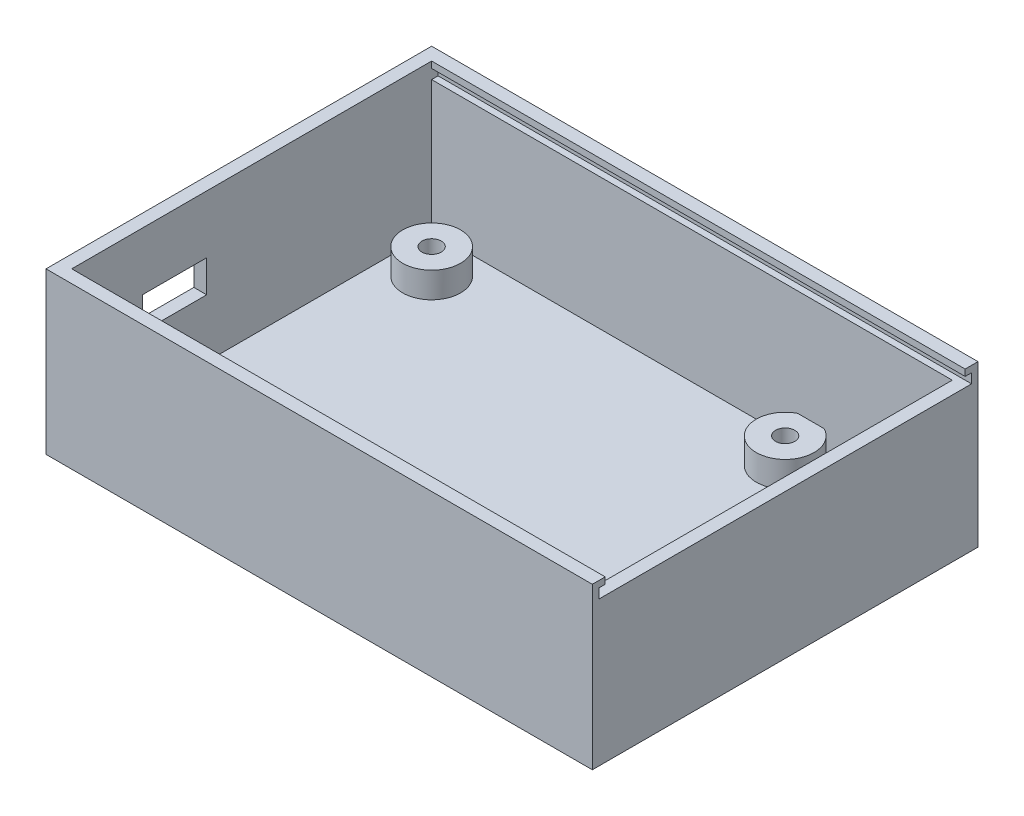
ISO-10303-21;
HEADER;
FILE_DESCRIPTION(('STEP AP214'),'2;1');
FILE_NAME('part.step','',(''),(''),'','','');
FILE_SCHEMA(('AUTOMOTIVE_DESIGN { 1 0 10303 214 1 1 1 1 }'));
ENDSEC;
DATA;
#1=APPLICATION_CONTEXT('core data for automotive mechanical design processes');
#2=APPLICATION_PROTOCOL_DEFINITION('international standard','automotive_design',2000,#1);
#3=PRODUCT_CONTEXT('',#1,'mechanical');
#4=PRODUCT('Part','Part','',(#3));
#5=PRODUCT_RELATED_PRODUCT_CATEGORY('part','',(#4));
#6=PRODUCT_DEFINITION_FORMATION('','',#4);
#7=PRODUCT_DEFINITION_CONTEXT('part definition',#1,'design');
#8=PRODUCT_DEFINITION('design','',#6,#7);
#9=PRODUCT_DEFINITION_SHAPE('','',#8);
#10=(LENGTH_UNIT() NAMED_UNIT(*) SI_UNIT(.MILLI.,.METRE.));
#11=(NAMED_UNIT(*) PLANE_ANGLE_UNIT() SI_UNIT($,.RADIAN.));
#12=(NAMED_UNIT(*) SI_UNIT($,.STERADIAN.) SOLID_ANGLE_UNIT());
#13=UNCERTAINTY_MEASURE_WITH_UNIT(LENGTH_MEASURE(1.E-05),#10,'distance_accuracy_value','');
#14=(GEOMETRIC_REPRESENTATION_CONTEXT(3) GLOBAL_UNCERTAINTY_ASSIGNED_CONTEXT((#13)) GLOBAL_UNIT_ASSIGNED_CONTEXT((#10,
#11,#12)) REPRESENTATION_CONTEXT('',''));
#15=CARTESIAN_POINT('',(0.,0.,0.));
#16=DIRECTION('',(0.,0.,1.));
#17=DIRECTION('',(1.,0.,0.));
#18=AXIS2_PLACEMENT_3D('',#15,#16,#17);
#19=CARTESIAN_POINT('',(0.,25.,-58.));
#20=DIRECTION('',(0.,0.,1.));
#21=DIRECTION('',(1.,0.,0.));
#22=AXIS2_PLACEMENT_3D('',#19,#20,#21);
#23=PLANE('',#22);
#24=DIRECTION('',(0.,-1.,0.));
#25=VECTOR('',#24,1.);
#26=CARTESIAN_POINT('',(2.,25.,-58.));
#27=LINE('',#26,#25);
#28=CARTESIAN_POINT('',(2.,25.,-58.));
#29=VERTEX_POINT('',#28);
#30=CARTESIAN_POINT('',(2.,24.,-58.));
#31=VERTEX_POINT('',#30);
#32=EDGE_CURVE('E304',#29,#31,#27,.T.);
#33=ORIENTED_EDGE('',*,*,#32,.T.);
#34=DIRECTION('',(1.,0.,0.));
#35=VECTOR('',#34,1.);
#36=CARTESIAN_POINT('',(-0.001000000000001,24.,-58.));
#37=LINE('',#36,#35);
#38=CARTESIAN_POINT('',(85.,24.,-58.));
#39=VERTEX_POINT('',#38);
#40=EDGE_CURVE('E232',#31,#39,#37,.T.);
#41=ORIENTED_EDGE('',*,*,#40,.T.);
#42=DIRECTION('',(0.,1.,0.));
#43=VECTOR('',#42,1.);
#44=CARTESIAN_POINT('',(85.,25.,-58.));
#45=LINE('',#44,#43);
#46=CARTESIAN_POINT('',(85.,25.,-58.));
#47=VERTEX_POINT('',#46);
#48=EDGE_CURVE('E228',#39,#47,#45,.T.);
#49=ORIENTED_EDGE('',*,*,#48,.T.);
#50=DIRECTION('',(-1.,0.,0.));
#51=VECTOR('',#50,1.);
#52=CARTESIAN_POINT('',(0.,25.,-58.));
#53=LINE('',#52,#51);
#54=EDGE_CURVE('E325',#47,#29,#53,.T.);
#55=ORIENTED_EDGE('',*,*,#54,.T.);
#56=EDGE_LOOP('',(#33,#41,#49,#55));
#57=FACE_BOUND('',#56,.T.);
#58=ADVANCED_FACE('F34',(#57),#23,.T.);
#59=CARTESIAN_POINT('',(0.,25.,-2.));
#60=DIRECTION('',(0.,0.,-1.));
#61=DIRECTION('',(-1.,0.,0.));
#62=AXIS2_PLACEMENT_3D('',#59,#60,#61);
#63=PLANE('',#62);
#64=DIRECTION('',(1.,0.,0.));
#65=VECTOR('',#64,1.);
#66=CARTESIAN_POINT('',(-0.001000000000001,24.,-2.));
#67=LINE('',#66,#65);
#68=CARTESIAN_POINT('',(2.,24.,-2.));
#69=VERTEX_POINT('',#68);
#70=CARTESIAN_POINT('',(85.,24.,-2.));
#71=VERTEX_POINT('',#70);
#72=EDGE_CURVE('E231',#69,#71,#67,.T.);
#73=ORIENTED_EDGE('',*,*,#72,.F.);
#74=DIRECTION('',(0.,-1.,0.));
#75=VECTOR('',#74,1.);
#76=CARTESIAN_POINT('',(2.,25.,-2.));
#77=LINE('',#76,#75);
#78=CARTESIAN_POINT('',(2.,25.,-2.));
#79=VERTEX_POINT('',#78);
#80=EDGE_CURVE('E299',#79,#69,#77,.T.);
#81=ORIENTED_EDGE('',*,*,#80,.F.);
#82=DIRECTION('',(1.,0.,0.));
#83=VECTOR('',#82,1.);
#84=CARTESIAN_POINT('',(0.,25.,-2.));
#85=LINE('',#84,#83);
#86=CARTESIAN_POINT('',(85.,25.,-2.));
#87=VERTEX_POINT('',#86);
#88=EDGE_CURVE('E323',#79,#87,#85,.T.);
#89=ORIENTED_EDGE('',*,*,#88,.T.);
#90=DIRECTION('',(0.,-1.,0.));
#91=VECTOR('',#90,1.);
#92=CARTESIAN_POINT('',(85.,25.,-2.));
#93=LINE('',#92,#91);
#94=EDGE_CURVE('E225',#87,#71,#93,.T.);
#95=ORIENTED_EDGE('',*,*,#94,.T.);
#96=EDGE_LOOP('',(#73,#81,#89,#95));
#97=FACE_BOUND('',#96,.T.);
#98=ADVANCED_FACE('F376',(#97),#63,.T.);
#99=CARTESIAN_POINT('',(0.,2.,0.));
#100=DIRECTION('',(0.,-1.,0.));
#101=DIRECTION('',(0.,0.,-1.));
#102=AXIS2_PLACEMENT_3D('',#99,#100,#101);
#103=PLANE('',#102);
#104=CARTESIAN_POINT('',(7.99999999999999,2.,-52.));
#105=DIRECTION('',(0.,-1.,0.));
#106=DIRECTION('',(0.,0.,-1.));
#107=AXIS2_PLACEMENT_3D('',#104,#105,#106);
#108=CIRCLE('',#107,4.5);
#109=CARTESIAN_POINT('',(7.99999999999999,2.,-56.5));
#110=VERTEX_POINT('',#109);
#111=EDGE_CURVE('E358',#110,#110,#108,.F.);
#112=ORIENTED_EDGE('',*,*,#111,.F.);
#113=EDGE_LOOP('',(#112));
#114=FACE_BOUND('',#113,.T.);
#115=CARTESIAN_POINT('',(61.,2.,-54.));
#116=DIRECTION('',(0.,1.,0.));
#117=DIRECTION('',(0.,0.,1.));
#118=AXIS2_PLACEMENT_3D('',#115,#116,#117);
#119=CIRCLE('',#118,4.5);
#120=CARTESIAN_POINT('',(58.9384471871912,2.,-58.));
#121=VERTEX_POINT('',#120);
#122=CARTESIAN_POINT('',(63.0615528128088,2.,-58.));
#123=VERTEX_POINT('',#122);
#124=EDGE_CURVE('E279',#121,#123,#119,.T.);
#125=ORIENTED_EDGE('',*,*,#124,.F.);
#126=DIRECTION('',(-1.,0.,0.));
#127=VECTOR('',#126,1.);
#128=CARTESIAN_POINT('',(0.,2.,-58.));
#129=LINE('',#128,#127);
#130=CARTESIAN_POINT('',(2.,2.,-58.));
#131=VERTEX_POINT('',#130);
#132=EDGE_CURVE('E316',#121,#131,#129,.T.);
#133=ORIENTED_EDGE('',*,*,#132,.T.);
#134=DIRECTION('',(0.,0.,1.));
#135=VECTOR('',#134,1.);
#136=CARTESIAN_POINT('',(2.,2.,0.));
#137=LINE('',#136,#135);
#138=CARTESIAN_POINT('',(2.,2.,-2.));
#139=VERTEX_POINT('',#138);
#140=EDGE_CURVE('E295',#131,#139,#137,.T.);
#141=ORIENTED_EDGE('',*,*,#140,.T.);
#142=DIRECTION('',(1.,0.,0.));
#143=VECTOR('',#142,1.);
#144=CARTESIAN_POINT('',(0.,2.,-2.));
#145=LINE('',#144,#143);
#146=CARTESIAN_POINT('',(83.,2.,-2.));
#147=VERTEX_POINT('',#146);
#148=EDGE_CURVE('E298',#139,#147,#145,.T.);
#149=ORIENTED_EDGE('',*,*,#148,.T.);
#150=DIRECTION('',(0.,0.,-1.));
#151=VECTOR('',#150,1.);
#152=CARTESIAN_POINT('',(83.,2.,0.));
#153=LINE('',#152,#151);
#154=CARTESIAN_POINT('',(83.,2.,-58.));
#155=VERTEX_POINT('',#154);
#156=EDGE_CURVE('E311',#147,#155,#153,.T.);
#157=ORIENTED_EDGE('',*,*,#156,.T.);
#158=EDGE_CURVE('E318',#155,#123,#129,.T.);
#159=ORIENTED_EDGE('',*,*,#158,.T.);
#160=EDGE_LOOP('',(#125,#133,#141,#149,#157,#159));
#161=FACE_BOUND('',#160,.T.);
#162=CARTESIAN_POINT('',(68.,2.,-13.));
#163=DIRECTION('',(0.,-1.,0.));
#164=DIRECTION('',(0.,0.,-1.));
#165=AXIS2_PLACEMENT_3D('',#162,#163,#164);
#166=CIRCLE('',#165,4.5);
#167=CARTESIAN_POINT('',(68.,2.,-17.5));
#168=VERTEX_POINT('',#167);
#169=EDGE_CURVE('E42',#168,#168,#166,.F.);
#170=ORIENTED_EDGE('',*,*,#169,.F.);
#171=EDGE_LOOP('',(#170));
#172=FACE_BOUND('',#171,.T.);
#173=ADVANCED_FACE('F373',(#114,#161,#172),#103,.F.);
#174=DIRECTION('',(1.,0.,0.));
#175=VECTOR('',#174,1.);
#176=CARTESIAN_POINT('',(0.,22.5,-58.));
#177=LINE('',#176,#175);
#178=CARTESIAN_POINT('',(2.,22.5,-58.));
#179=VERTEX_POINT('',#178);
#180=CARTESIAN_POINT('',(83.,22.5,-58.));
#181=VERTEX_POINT('',#180);
#182=EDGE_CURVE('E48',#179,#181,#177,.T.);
#183=ORIENTED_EDGE('',*,*,#182,.F.);
#184=EDGE_CURVE('E308',#179,#131,#27,.T.);
#185=ORIENTED_EDGE('',*,*,#184,.T.);
#186=ORIENTED_EDGE('',*,*,#132,.F.);
#187=DIRECTION('',(0.,-1.,0.));
#188=VECTOR('',#187,1.);
#189=CARTESIAN_POINT('',(58.9384471871912,6.,-58.));
#190=LINE('',#189,#188);
#191=CARTESIAN_POINT('',(58.9384471871912,6.,-58.));
#192=VERTEX_POINT('',#191);
#193=EDGE_CURVE('E366',#121,#192,#190,.F.);
#194=ORIENTED_EDGE('',*,*,#193,.T.);
#195=DIRECTION('',(-1.,0.,0.));
#196=VECTOR('',#195,1.);
#197=CARTESIAN_POINT('',(0.,6.,-58.));
#198=LINE('',#197,#196);
#199=CARTESIAN_POINT('',(63.0615528128088,6.,-58.));
#200=VERTEX_POINT('',#199);
#201=EDGE_CURVE('E364',#200,#192,#198,.T.);
#202=ORIENTED_EDGE('',*,*,#201,.F.);
#203=DIRECTION('',(0.,-1.,0.));
#204=VECTOR('',#203,1.);
#205=CARTESIAN_POINT('',(63.0615528128088,6.,-58.));
#206=LINE('',#205,#204);
#207=EDGE_CURVE('E361',#200,#123,#206,.T.);
#208=ORIENTED_EDGE('',*,*,#207,.T.);
#209=ORIENTED_EDGE('',*,*,#158,.F.);
#210=DIRECTION('',(0.,-1.,0.));
#211=VECTOR('',#210,1.);
#212=CARTESIAN_POINT('',(83.,25.,-58.));
#213=LINE('',#212,#211);
#214=EDGE_CURVE('E307',#181,#155,#213,.T.);
#215=ORIENTED_EDGE('',*,*,#214,.F.);
#216=EDGE_LOOP('',(#183,#185,#186,#194,#202,#208,#209,#215));
#217=FACE_BOUND('',#216,.T.);
#218=ADVANCED_FACE('F375',(#217),#23,.T.);
#219=CARTESIAN_POINT('',(0.,25.,0.));
#220=DIRECTION('',(0.,-1.,0.));
#221=DIRECTION('',(0.,0.,-1.));
#222=AXIS2_PLACEMENT_3D('',#219,#220,#221);
#223=PLANE('',#222);
#224=ORIENTED_EDGE('',*,*,#54,.F.);
#225=DIRECTION('',(0.,0.,-1.));
#226=VECTOR('',#225,1.);
#227=CARTESIAN_POINT('',(85.,25.,0.));
#228=LINE('',#227,#226);
#229=CARTESIAN_POINT('',(85.,25.,-60.));
#230=VERTEX_POINT('',#229);
#231=EDGE_CURVE('E333',#47,#230,#228,.T.);
#232=ORIENTED_EDGE('',*,*,#231,.T.);
#233=DIRECTION('',(-1.,0.,0.));
#234=VECTOR('',#233,1.);
#235=CARTESIAN_POINT('',(0.,25.,-60.));
#236=LINE('',#235,#234);
#237=CARTESIAN_POINT('',(0.,25.,-60.));
#238=VERTEX_POINT('',#237);
#239=EDGE_CURVE('E337',#230,#238,#236,.T.);
#240=ORIENTED_EDGE('',*,*,#239,.T.);
#241=DIRECTION('',(0.,0.,1.));
#242=VECTOR('',#241,1.);
#243=CARTESIAN_POINT('',(0.,25.,0.));
#244=LINE('',#243,#242);
#245=CARTESIAN_POINT('',(0.,25.,0.));
#246=VERTEX_POINT('',#245);
#247=EDGE_CURVE('E327',#238,#246,#244,.T.);
#248=ORIENTED_EDGE('',*,*,#247,.T.);
#249=DIRECTION('',(1.,0.,0.));
#250=VECTOR('',#249,1.);
#251=CARTESIAN_POINT('',(0.,25.,0.));
#252=LINE('',#251,#250);
#253=CARTESIAN_POINT('',(85.,25.,0.));
#254=VERTEX_POINT('',#253);
#255=EDGE_CURVE('E330',#246,#254,#252,.T.);
#256=ORIENTED_EDGE('',*,*,#255,.T.);
#257=EDGE_CURVE('E334',#254,#87,#228,.T.);
#258=ORIENTED_EDGE('',*,*,#257,.T.);
#259=ORIENTED_EDGE('',*,*,#88,.F.);
#260=DIRECTION('',(0.,0.,1.));
#261=VECTOR('',#260,1.);
#262=CARTESIAN_POINT('',(2.,25.,0.));
#263=LINE('',#262,#261);
#264=EDGE_CURVE('E321',#29,#79,#263,.T.);
#265=ORIENTED_EDGE('',*,*,#264,.F.);
#266=EDGE_LOOP('',(#224,#232,#240,#248,#256,#258,#259,#265));
#267=FACE_BOUND('',#266,.T.);
#268=ADVANCED_FACE('F385',(#267),#223,.F.);
#269=CARTESIAN_POINT('',(0.,25.,0.));
#270=DIRECTION('',(1.,0.,0.));
#271=DIRECTION('',(0.,0.,-1.));
#272=AXIS2_PLACEMENT_3D('',#269,#270,#271);
#273=PLANE('',#272);
#274=DIRECTION('',(0.,0.,1.));
#275=VECTOR('',#274,1.);
#276=CARTESIAN_POINT('',(0.,11.,-23.));
#277=LINE('',#276,#275);
#278=CARTESIAN_POINT('',(0.,11.,-23.));
#279=VERTEX_POINT('',#278);
#280=CARTESIAN_POINT('',(0.,11.,-13.));
#281=VERTEX_POINT('',#280);
#282=EDGE_CURVE('E249',#279,#281,#277,.T.);
#283=ORIENTED_EDGE('',*,*,#282,.F.);
#284=DIRECTION('',(0.,-1.,0.));
#285=VECTOR('',#284,1.);
#286=CARTESIAN_POINT('',(0.,11.,-23.));
#287=LINE('',#286,#285);
#288=CARTESIAN_POINT('',(0.,16.,-23.));
#289=VERTEX_POINT('',#288);
#290=EDGE_CURVE('E56',#289,#279,#287,.T.);
#291=ORIENTED_EDGE('',*,*,#290,.F.);
#292=DIRECTION('',(0.,0.,-1.));
#293=VECTOR('',#292,1.);
#294=CARTESIAN_POINT('',(0.,16.,-23.));
#295=LINE('',#294,#293);
#296=CARTESIAN_POINT('',(0.,16.,-13.));
#297=VERTEX_POINT('',#296);
#298=EDGE_CURVE('E242',#297,#289,#295,.T.);
#299=ORIENTED_EDGE('',*,*,#298,.F.);
#300=DIRECTION('',(0.,1.,0.));
#301=VECTOR('',#300,1.);
#302=CARTESIAN_POINT('',(0.,11.,-13.));
#303=LINE('',#302,#301);
#304=EDGE_CURVE('E246',#281,#297,#303,.T.);
#305=ORIENTED_EDGE('',*,*,#304,.F.);
#306=EDGE_LOOP('',(#283,#291,#299,#305));
#307=FACE_BOUND('',#306,.T.);
#308=DIRECTION('',(0.,0.,1.));
#309=VECTOR('',#308,1.);
#310=CARTESIAN_POINT('',(0.,0.,0.));
#311=LINE('',#310,#309);
#312=CARTESIAN_POINT('',(0.,0.,-60.));
#313=VERTEX_POINT('',#312);
#314=CARTESIAN_POINT('',(0.,0.,0.));
#315=VERTEX_POINT('',#314);
#316=EDGE_CURVE('E302',#313,#315,#311,.T.);
#317=ORIENTED_EDGE('',*,*,#316,.T.);
#318=DIRECTION('',(0.,-1.,0.));
#319=VECTOR('',#318,1.);
#320=CARTESIAN_POINT('',(0.,25.,0.));
#321=LINE('',#320,#319);
#322=EDGE_CURVE('E355',#246,#315,#321,.T.);
#323=ORIENTED_EDGE('',*,*,#322,.F.);
#324=ORIENTED_EDGE('',*,*,#247,.F.);
#325=DIRECTION('',(0.,-1.,0.));
#326=VECTOR('',#325,1.);
#327=CARTESIAN_POINT('',(0.,25.,-60.));
#328=LINE('',#327,#326);
#329=EDGE_CURVE('E339',#238,#313,#328,.T.);
#330=ORIENTED_EDGE('',*,*,#329,.T.);
#331=EDGE_LOOP('',(#317,#323,#324,#330));
#332=FACE_BOUND('',#331,.T.);
#333=ADVANCED_FACE('F36',(#307,#332),#273,.F.);
#334=CARTESIAN_POINT('',(0.,25.,0.));
#335=DIRECTION('',(0.,0.,-1.));
#336=DIRECTION('',(-1.,0.,0.));
#337=AXIS2_PLACEMENT_3D('',#334,#335,#336);
#338=PLANE('',#337);
#339=DIRECTION('',(1.,0.,0.));
#340=VECTOR('',#339,1.);
#341=CARTESIAN_POINT('',(0.,0.,0.));
#342=LINE('',#341,#340);
#343=CARTESIAN_POINT('',(85.,0.,0.));
#344=VERTEX_POINT('',#343);
#345=EDGE_CURVE('E342',#315,#344,#342,.T.);
#346=ORIENTED_EDGE('',*,*,#345,.T.);
#347=DIRECTION('',(0.,-1.,0.));
#348=VECTOR('',#347,1.);
#349=CARTESIAN_POINT('',(85.,25.,0.));
#350=LINE('',#349,#348);
#351=EDGE_CURVE('E352',#254,#344,#350,.T.);
#352=ORIENTED_EDGE('',*,*,#351,.F.);
#353=ORIENTED_EDGE('',*,*,#255,.F.);
#354=ORIENTED_EDGE('',*,*,#322,.T.);
#355=EDGE_LOOP('',(#346,#352,#353,#354));
#356=FACE_BOUND('',#355,.T.);
#357=ADVANCED_FACE('F615',(#356),#338,.F.);
#358=CARTESIAN_POINT('',(85.,25.,0.));
#359=DIRECTION('',(-1.,0.,0.));
#360=DIRECTION('',(0.,0.,1.));
#361=AXIS2_PLACEMENT_3D('',#358,#359,#360);
#362=PLANE('',#361);
#363=DIRECTION('',(0.,-1.,0.));
#364=VECTOR('',#363,1.);
#365=CARTESIAN_POINT('',(85.,22.5,-1.));
#366=LINE('',#365,#364);
#367=CARTESIAN_POINT('',(85.,24.,-1.));
#368=VERTEX_POINT('',#367);
#369=CARTESIAN_POINT('',(85.,22.5,-1.));
#370=VERTEX_POINT('',#369);
#371=EDGE_CURVE('E198',#368,#370,#366,.T.);
#372=ORIENTED_EDGE('',*,*,#371,.F.);
#373=DIRECTION('',(0.,0.,1.));
#374=VECTOR('',#373,1.);
#375=CARTESIAN_POINT('',(85.,24.,-1.));
#376=LINE('',#375,#374);
#377=EDGE_CURVE('E210',#71,#368,#376,.T.);
#378=ORIENTED_EDGE('',*,*,#377,.F.);
#379=ORIENTED_EDGE('',*,*,#94,.F.);
#380=ORIENTED_EDGE('',*,*,#257,.F.);
#381=ORIENTED_EDGE('',*,*,#351,.T.);
#382=DIRECTION('',(0.,0.,-1.));
#383=VECTOR('',#382,1.);
#384=CARTESIAN_POINT('',(85.,0.,0.));
#385=LINE('',#384,#383);
#386=CARTESIAN_POINT('',(85.,0.,-60.));
#387=VERTEX_POINT('',#386);
#388=EDGE_CURVE('E344',#344,#387,#385,.T.);
#389=ORIENTED_EDGE('',*,*,#388,.T.);
#390=DIRECTION('',(0.,-1.,0.));
#391=VECTOR('',#390,1.);
#392=CARTESIAN_POINT('',(85.,25.,-60.));
#393=LINE('',#392,#391);
#394=EDGE_CURVE('E349',#230,#387,#393,.T.);
#395=ORIENTED_EDGE('',*,*,#394,.F.);
#396=ORIENTED_EDGE('',*,*,#231,.F.);
#397=ORIENTED_EDGE('',*,*,#48,.F.);
#398=CARTESIAN_POINT('',(85.,24.,-59.));
#399=VERTEX_POINT('',#398);
#400=EDGE_CURVE('E194',#399,#39,#376,.T.);
#401=ORIENTED_EDGE('',*,*,#400,.F.);
#402=DIRECTION('',(0.,1.,0.));
#403=VECTOR('',#402,1.);
#404=CARTESIAN_POINT('',(85.,22.5,-59.));
#405=LINE('',#404,#403);
#406=CARTESIAN_POINT('',(85.,22.5,-59.));
#407=VERTEX_POINT('',#406);
#408=EDGE_CURVE('E208',#407,#399,#405,.T.);
#409=ORIENTED_EDGE('',*,*,#408,.F.);
#410=DIRECTION('',(0.,0.,-1.));
#411=VECTOR('',#410,1.);
#412=CARTESIAN_POINT('',(85.,22.5,-1.));
#413=LINE('',#412,#411);
#414=EDGE_CURVE('E187',#370,#407,#413,.T.);
#415=ORIENTED_EDGE('',*,*,#414,.F.);
#416=EDGE_LOOP('',(#372,#378,#379,#380,#381,#389,#395,#396,#397,#401,#409,#415));
#417=FACE_BOUND('',#416,.T.);
#418=ADVANCED_FACE('F205',(#417),#362,.F.);
#419=CARTESIAN_POINT('',(0.,25.,-60.));
#420=DIRECTION('',(0.,0.,1.));
#421=DIRECTION('',(1.,0.,0.));
#422=AXIS2_PLACEMENT_3D('',#419,#420,#421);
#423=PLANE('',#422);
#424=DIRECTION('',(-1.,0.,0.));
#425=VECTOR('',#424,1.);
#426=CARTESIAN_POINT('',(0.,0.,-60.));
#427=LINE('',#426,#425);
#428=EDGE_CURVE('E331',#387,#313,#427,.T.);
#429=ORIENTED_EDGE('',*,*,#428,.T.);
#430=ORIENTED_EDGE('',*,*,#329,.F.);
#431=ORIENTED_EDGE('',*,*,#239,.F.);
#432=ORIENTED_EDGE('',*,*,#394,.T.);
#433=EDGE_LOOP('',(#429,#430,#431,#432));
#434=FACE_BOUND('',#433,.T.);
#435=ADVANCED_FACE('F507',(#434),#423,.F.);
#436=CARTESIAN_POINT('',(0.,0.,0.));
#437=DIRECTION('',(0.,-1.,0.));
#438=DIRECTION('',(0.,0.,-1.));
#439=AXIS2_PLACEMENT_3D('',#436,#437,#438);
#440=PLANE('',#439);
#441=ORIENTED_EDGE('',*,*,#316,.F.);
#442=ORIENTED_EDGE('',*,*,#428,.F.);
#443=ORIENTED_EDGE('',*,*,#388,.F.);
#444=ORIENTED_EDGE('',*,*,#345,.F.);
#445=EDGE_LOOP('',(#441,#442,#443,#444));
#446=FACE_BOUND('',#445,.T.);
#447=ADVANCED_FACE('F418',(#446),#440,.T.);
#448=CARTESIAN_POINT('',(2.,25.,0.));
#449=DIRECTION('',(1.,0.,0.));
#450=DIRECTION('',(0.,0.,-1.));
#451=AXIS2_PLACEMENT_3D('',#448,#449,#450);
#452=PLANE('',#451);
#453=ORIENTED_EDGE('',*,*,#184,.F.);
#454=DIRECTION('',(0.,0.,1.));
#455=VECTOR('',#454,1.);
#456=CARTESIAN_POINT('',(2.,22.5,-1.));
#457=LINE('',#456,#455);
#458=CARTESIAN_POINT('',(2.,22.5,-59.));
#459=VERTEX_POINT('',#458);
#460=EDGE_CURVE('E220',#459,#179,#457,.T.);
#461=ORIENTED_EDGE('',*,*,#460,.F.);
#462=DIRECTION('',(0.,-1.,0.));
#463=VECTOR('',#462,1.);
#464=CARTESIAN_POINT('',(2.,22.5,-59.));
#465=LINE('',#464,#463);
#466=CARTESIAN_POINT('',(2.,24.,-59.));
#467=VERTEX_POINT('',#466);
#468=EDGE_CURVE('E216',#467,#459,#465,.T.);
#469=ORIENTED_EDGE('',*,*,#468,.F.);
#470=DIRECTION('',(0.,0.,-1.));
#471=VECTOR('',#470,1.);
#472=CARTESIAN_POINT('',(2.,24.,-1.));
#473=LINE('',#472,#471);
#474=EDGE_CURVE('E487',#31,#467,#473,.T.);
#475=ORIENTED_EDGE('',*,*,#474,.F.);
#476=ORIENTED_EDGE('',*,*,#32,.F.);
#477=ORIENTED_EDGE('',*,*,#264,.T.);
#478=ORIENTED_EDGE('',*,*,#80,.T.);
#479=CARTESIAN_POINT('',(2.,24.,-1.));
#480=VERTEX_POINT('',#479);
#481=EDGE_CURVE('E485',#480,#69,#473,.T.);
#482=ORIENTED_EDGE('',*,*,#481,.F.);
#483=DIRECTION('',(0.,1.,0.));
#484=VECTOR('',#483,1.);
#485=CARTESIAN_POINT('',(2.,22.5,-1.));
#486=LINE('',#485,#484);
#487=CARTESIAN_POINT('',(2.,22.5,-1.));
#488=VERTEX_POINT('',#487);
#489=EDGE_CURVE('E486',#488,#480,#486,.T.);
#490=ORIENTED_EDGE('',*,*,#489,.F.);
#491=CARTESIAN_POINT('',(2.,22.5,-2.));
#492=VERTEX_POINT('',#491);
#493=EDGE_CURVE('E190',#492,#488,#457,.T.);
#494=ORIENTED_EDGE('',*,*,#493,.F.);
#495=EDGE_CURVE('E303',#492,#139,#77,.T.);
#496=ORIENTED_EDGE('',*,*,#495,.T.);
#497=ORIENTED_EDGE('',*,*,#140,.F.);
#498=EDGE_LOOP('',(#453,#461,#469,#475,#476,#477,#478,#482,#490,#494,#496,#497));
#499=FACE_BOUND('',#498,.T.);
#500=DIRECTION('',(0.,-1.,0.));
#501=VECTOR('',#500,1.);
#502=CARTESIAN_POINT('',(2.,11.,-23.));
#503=LINE('',#502,#501);
#504=CARTESIAN_POINT('',(2.,16.,-23.));
#505=VERTEX_POINT('',#504);
#506=CARTESIAN_POINT('',(2.,11.,-23.));
#507=VERTEX_POINT('',#506);
#508=EDGE_CURVE('E235',#505,#507,#503,.T.);
#509=ORIENTED_EDGE('',*,*,#508,.T.);
#510=DIRECTION('',(0.,0.,1.));
#511=VECTOR('',#510,1.);
#512=CARTESIAN_POINT('',(2.,11.,-23.));
#513=LINE('',#512,#511);
#514=CARTESIAN_POINT('',(2.,11.,-13.));
#515=VERTEX_POINT('',#514);
#516=EDGE_CURVE('E237',#507,#515,#513,.T.);
#517=ORIENTED_EDGE('',*,*,#516,.T.);
#518=DIRECTION('',(0.,1.,0.));
#519=VECTOR('',#518,1.);
#520=CARTESIAN_POINT('',(2.,11.,-13.));
#521=LINE('',#520,#519);
#522=CARTESIAN_POINT('',(2.,16.,-13.));
#523=VERTEX_POINT('',#522);
#524=EDGE_CURVE('E260',#515,#523,#521,.T.);
#525=ORIENTED_EDGE('',*,*,#524,.T.);
#526=DIRECTION('',(0.,0.,-1.));
#527=VECTOR('',#526,1.);
#528=CARTESIAN_POINT('',(2.,16.,-23.));
#529=LINE('',#528,#527);
#530=EDGE_CURVE('E256',#523,#505,#529,.T.);
#531=ORIENTED_EDGE('',*,*,#530,.T.);
#532=EDGE_LOOP('',(#509,#517,#525,#531));
#533=FACE_BOUND('',#532,.T.);
#534=ADVANCED_FACE('F414',(#499,#533),#452,.T.);
#535=DIRECTION('',(-1.,0.,0.));
#536=VECTOR('',#535,1.);
#537=CARTESIAN_POINT('',(0.,22.5,-2.));
#538=LINE('',#537,#536);
#539=CARTESIAN_POINT('',(83.,22.5,-2.));
#540=VERTEX_POINT('',#539);
#541=EDGE_CURVE('E222',#540,#492,#538,.T.);
#542=ORIENTED_EDGE('',*,*,#541,.F.);
#543=DIRECTION('',(0.,-1.,0.));
#544=VECTOR('',#543,1.);
#545=CARTESIAN_POINT('',(83.,25.,-2.));
#546=LINE('',#545,#544);
#547=EDGE_CURVE('E312',#540,#147,#546,.T.);
#548=ORIENTED_EDGE('',*,*,#547,.T.);
#549=ORIENTED_EDGE('',*,*,#148,.F.);
#550=ORIENTED_EDGE('',*,*,#495,.F.);
#551=EDGE_LOOP('',(#542,#548,#549,#550));
#552=FACE_BOUND('',#551,.T.);
#553=ADVANCED_FACE('F390',(#552),#63,.T.);
#554=CARTESIAN_POINT('',(83.,25.,0.));
#555=DIRECTION('',(-1.,0.,0.));
#556=DIRECTION('',(0.,0.,1.));
#557=AXIS2_PLACEMENT_3D('',#554,#555,#556);
#558=PLANE('',#557);
#559=DIRECTION('',(0.,0.,1.));
#560=VECTOR('',#559,1.);
#561=CARTESIAN_POINT('',(83.,22.5,0.));
#562=LINE('',#561,#560);
#563=EDGE_CURVE('E11',#181,#540,#562,.T.);
#564=ORIENTED_EDGE('',*,*,#563,.F.);
#565=ORIENTED_EDGE('',*,*,#214,.T.);
#566=ORIENTED_EDGE('',*,*,#156,.F.);
#567=ORIENTED_EDGE('',*,*,#547,.F.);
#568=EDGE_LOOP('',(#564,#565,#566,#567));
#569=FACE_BOUND('',#568,.T.);
#570=ADVANCED_FACE('F408',(#569),#558,.T.);
#571=CARTESIAN_POINT('',(7.99999999999999,6.,-52.));
#572=DIRECTION('',(0.,1.,0.));
#573=DIRECTION('',(0.,0.,1.));
#574=AXIS2_PLACEMENT_3D('',#571,#572,#573);
#575=PLANE('',#574);
#576=CARTESIAN_POINT('',(7.99999999999999,6.,-52.));
#577=DIRECTION('',(0.,1.,0.));
#578=DIRECTION('',(0.,0.,1.));
#579=AXIS2_PLACEMENT_3D('',#576,#577,#578);
#580=CIRCLE('',#579,4.5);
#581=CARTESIAN_POINT('',(7.99999999999999,6.,-47.5));
#582=VERTEX_POINT('',#581);
#583=EDGE_CURVE('E290',#582,#582,#580,.T.);
#584=ORIENTED_EDGE('',*,*,#583,.T.);
#585=EDGE_LOOP('',(#584));
#586=FACE_BOUND('',#585,.T.);
#587=CARTESIAN_POINT('',(7.99999999999999,6.,-52.));
#588=DIRECTION('',(0.,1.,0.));
#589=DIRECTION('',(0.,0.,1.));
#590=AXIS2_PLACEMENT_3D('',#587,#588,#589);
#591=CIRCLE('',#590,1.5);
#592=CARTESIAN_POINT('',(7.99999999999999,6.,-50.5));
#593=VERTEX_POINT('',#592);
#594=EDGE_CURVE('E287',#593,#593,#591,.T.);
#595=ORIENTED_EDGE('',*,*,#594,.F.);
#596=EDGE_LOOP('',(#595));
#597=FACE_BOUND('',#596,.T.);
#598=ADVANCED_FACE('F410',(#586,#597),#575,.T.);
#599=CARTESIAN_POINT('',(7.99999999999999,6.,-52.));
#600=DIRECTION('',(0.,-1.,0.));
#601=DIRECTION('',(0.,0.,-1.));
#602=AXIS2_PLACEMENT_3D('',#599,#600,#601);
#603=CYLINDRICAL_SURFACE('',#602,4.5);
#604=ORIENTED_EDGE('',*,*,#583,.F.);
#605=EDGE_LOOP('',(#604));
#606=FACE_BOUND('',#605,.T.);
#607=ORIENTED_EDGE('',*,*,#111,.T.);
#608=EDGE_LOOP('',(#607));
#609=FACE_BOUND('',#608,.T.);
#610=ADVANCED_FACE('F420',(#606,#609),#603,.T.);
#611=CARTESIAN_POINT('',(7.99999999999999,6.,-52.));
#612=DIRECTION('',(0.,-1.,0.));
#613=DIRECTION('',(0.,0.,-1.));
#614=AXIS2_PLACEMENT_3D('',#611,#612,#613);
#615=CYLINDRICAL_SURFACE('',#614,1.5);
#616=ORIENTED_EDGE('',*,*,#594,.T.);
#617=EDGE_LOOP('',(#616));
#618=FACE_BOUND('',#617,.T.);
#619=CARTESIAN_POINT('',(7.99999999999999,2.,-52.));
#620=DIRECTION('',(0.,1.,0.));
#621=DIRECTION('',(0.,0.,1.));
#622=AXIS2_PLACEMENT_3D('',#619,#620,#621);
#623=CIRCLE('',#622,1.5);
#624=CARTESIAN_POINT('',(7.99999999999999,2.,-50.5));
#625=VERTEX_POINT('',#624);
#626=EDGE_CURVE('E285',#625,#625,#623,.T.);
#627=ORIENTED_EDGE('',*,*,#626,.F.);
#628=EDGE_LOOP('',(#627));
#629=FACE_BOUND('',#628,.T.);
#630=ADVANCED_FACE('F401',(#618,#629),#615,.F.);
#631=ORIENTED_EDGE('',*,*,#626,.T.);
#632=EDGE_LOOP('',(#631));
#633=FACE_BOUND('',#632,.T.);
#634=ADVANCED_FACE('F380',(#633),#103,.F.);
#635=CARTESIAN_POINT('',(61.,6.,-54.));
#636=DIRECTION('',(0.,1.,0.));
#637=DIRECTION('',(0.,0.,1.));
#638=AXIS2_PLACEMENT_3D('',#635,#636,#637);
#639=PLANE('',#638);
#640=CARTESIAN_POINT('',(61.,6.,-54.));
#641=DIRECTION('',(0.,1.,0.));
#642=DIRECTION('',(0.,0.,1.));
#643=AXIS2_PLACEMENT_3D('',#640,#641,#642);
#644=CIRCLE('',#643,4.5);
#645=EDGE_CURVE('E282',#192,#200,#644,.T.);
#646=ORIENTED_EDGE('',*,*,#645,.T.);
#647=ORIENTED_EDGE('',*,*,#201,.T.);
#648=EDGE_LOOP('',(#646,#647));
#649=FACE_BOUND('',#648,.T.);
#650=CARTESIAN_POINT('',(61.,6.,-54.));
#651=DIRECTION('',(0.,1.,0.));
#652=DIRECTION('',(0.,0.,1.));
#653=AXIS2_PLACEMENT_3D('',#650,#651,#652);
#654=CIRCLE('',#653,1.5);
#655=CARTESIAN_POINT('',(61.,6.,-52.5));
#656=VERTEX_POINT('',#655);
#657=EDGE_CURVE('E276',#656,#656,#654,.T.);
#658=ORIENTED_EDGE('',*,*,#657,.F.);
#659=EDGE_LOOP('',(#658));
#660=FACE_BOUND('',#659,.T.);
#661=ADVANCED_FACE('F400',(#649,#660),#639,.T.);
#662=CARTESIAN_POINT('',(61.,6.,-54.));
#663=DIRECTION('',(0.,-1.,0.));
#664=DIRECTION('',(0.,0.,-1.));
#665=AXIS2_PLACEMENT_3D('',#662,#663,#664);
#666=CYLINDRICAL_SURFACE('',#665,4.5);
#667=ORIENTED_EDGE('',*,*,#193,.F.);
#668=ORIENTED_EDGE('',*,*,#124,.T.);
#669=ORIENTED_EDGE('',*,*,#207,.F.);
#670=ORIENTED_EDGE('',*,*,#645,.F.);
#671=EDGE_LOOP('',(#667,#668,#669,#670));
#672=FACE_BOUND('',#671,.T.);
#673=ADVANCED_FACE('F430',(#672),#666,.T.);
#674=CARTESIAN_POINT('',(61.,6.,-54.));
#675=DIRECTION('',(0.,-1.,0.));
#676=DIRECTION('',(0.,0.,-1.));
#677=AXIS2_PLACEMENT_3D('',#674,#675,#676);
#678=CYLINDRICAL_SURFACE('',#677,1.5);
#679=ORIENTED_EDGE('',*,*,#657,.T.);
#680=EDGE_LOOP('',(#679));
#681=FACE_BOUND('',#680,.T.);
#682=CARTESIAN_POINT('',(61.,2.,-54.));
#683=DIRECTION('',(0.,1.,0.));
#684=DIRECTION('',(0.,0.,1.));
#685=AXIS2_PLACEMENT_3D('',#682,#683,#684);
#686=CIRCLE('',#685,1.5);
#687=CARTESIAN_POINT('',(61.,2.,-52.5));
#688=VERTEX_POINT('',#687);
#689=EDGE_CURVE('E275',#688,#688,#686,.T.);
#690=ORIENTED_EDGE('',*,*,#689,.F.);
#691=EDGE_LOOP('',(#690));
#692=FACE_BOUND('',#691,.T.);
#693=ADVANCED_FACE('F433',(#681,#692),#678,.F.);
#694=ORIENTED_EDGE('',*,*,#689,.T.);
#695=EDGE_LOOP('',(#694));
#696=FACE_BOUND('',#695,.T.);
#697=ADVANCED_FACE('F398',(#696),#103,.F.);
#698=CARTESIAN_POINT('',(68.,6.,-13.));
#699=DIRECTION('',(0.,1.,0.));
#700=DIRECTION('',(0.,0.,1.));
#701=AXIS2_PLACEMENT_3D('',#698,#699,#700);
#702=PLANE('',#701);
#703=CARTESIAN_POINT('',(68.,6.,-13.));
#704=DIRECTION('',(0.,1.,0.));
#705=DIRECTION('',(0.,0.,1.));
#706=AXIS2_PLACEMENT_3D('',#703,#704,#705);
#707=CIRCLE('',#706,4.5);
#708=CARTESIAN_POINT('',(68.,6.,-8.49999999999999));
#709=VERTEX_POINT('',#708);
#710=EDGE_CURVE('E270',#709,#709,#707,.T.);
#711=ORIENTED_EDGE('',*,*,#710,.T.);
#712=EDGE_LOOP('',(#711));
#713=FACE_BOUND('',#712,.T.);
#714=CARTESIAN_POINT('',(68.,6.,-13.));
#715=DIRECTION('',(0.,1.,0.));
#716=DIRECTION('',(0.,0.,1.));
#717=AXIS2_PLACEMENT_3D('',#714,#715,#716);
#718=CIRCLE('',#717,1.5);
#719=CARTESIAN_POINT('',(68.,6.,-11.5));
#720=VERTEX_POINT('',#719);
#721=EDGE_CURVE('E267',#720,#720,#718,.T.);
#722=ORIENTED_EDGE('',*,*,#721,.F.);
#723=EDGE_LOOP('',(#722));
#724=FACE_BOUND('',#723,.T.);
#725=ADVANCED_FACE('F443',(#713,#724),#702,.T.);
#726=CARTESIAN_POINT('',(68.,6.,-13.));
#727=DIRECTION('',(0.,-1.,0.));
#728=DIRECTION('',(0.,0.,-1.));
#729=AXIS2_PLACEMENT_3D('',#726,#727,#728);
#730=CYLINDRICAL_SURFACE('',#729,4.5);
#731=ORIENTED_EDGE('',*,*,#710,.F.);
#732=EDGE_LOOP('',(#731));
#733=FACE_BOUND('',#732,.T.);
#734=ORIENTED_EDGE('',*,*,#169,.T.);
#735=EDGE_LOOP('',(#734));
#736=FACE_BOUND('',#735,.T.);
#737=ADVANCED_FACE('F371',(#733,#736),#730,.T.);
#738=CARTESIAN_POINT('',(68.,6.,-13.));
#739=DIRECTION('',(0.,-1.,0.));
#740=DIRECTION('',(0.,0.,-1.));
#741=AXIS2_PLACEMENT_3D('',#738,#739,#740);
#742=CYLINDRICAL_SURFACE('',#741,1.5);
#743=ORIENTED_EDGE('',*,*,#721,.T.);
#744=EDGE_LOOP('',(#743));
#745=FACE_BOUND('',#744,.T.);
#746=CARTESIAN_POINT('',(68.,2.,-13.));
#747=DIRECTION('',(0.,1.,0.));
#748=DIRECTION('',(0.,0.,1.));
#749=AXIS2_PLACEMENT_3D('',#746,#747,#748);
#750=CIRCLE('',#749,1.5);
#751=CARTESIAN_POINT('',(68.,2.,-11.5));
#752=VERTEX_POINT('',#751);
#753=EDGE_CURVE('E245',#752,#752,#750,.T.);
#754=ORIENTED_EDGE('',*,*,#753,.F.);
#755=EDGE_LOOP('',(#754));
#756=FACE_BOUND('',#755,.T.);
#757=ADVANCED_FACE('F396',(#745,#756),#742,.F.);
#758=ORIENTED_EDGE('',*,*,#753,.T.);
#759=EDGE_LOOP('',(#758));
#760=FACE_BOUND('',#759,.T.);
#761=ADVANCED_FACE('F379',(#760),#103,.F.);
#762=CARTESIAN_POINT('',(85.001,11.,-23.));
#763=DIRECTION('',(0.,0.,-1.));
#764=DIRECTION('',(-1.,0.,0.));
#765=AXIS2_PLACEMENT_3D('',#762,#763,#764);
#766=PLANE('',#765);
#767=DIRECTION('',(-1.,0.,0.));
#768=VECTOR('',#767,1.);
#769=CARTESIAN_POINT('',(85.001,16.,-23.));
#770=LINE('',#769,#768);
#771=EDGE_CURVE('E259',#505,#289,#770,.T.);
#772=ORIENTED_EDGE('',*,*,#771,.T.);
#773=ORIENTED_EDGE('',*,*,#290,.T.);
#774=DIRECTION('',(-1.,0.,0.));
#775=VECTOR('',#774,1.);
#776=CARTESIAN_POINT('',(85.001,11.,-23.));
#777=LINE('',#776,#775);
#778=EDGE_CURVE('E255',#507,#279,#777,.T.);
#779=ORIENTED_EDGE('',*,*,#778,.F.);
#780=ORIENTED_EDGE('',*,*,#508,.F.);
#781=EDGE_LOOP('',(#772,#773,#779,#780));
#782=FACE_BOUND('',#781,.T.);
#783=ADVANCED_FACE('F395',(#782),#766,.F.);
#784=CARTESIAN_POINT('',(85.001,16.,-23.));
#785=DIRECTION('',(0.,1.,0.));
#786=DIRECTION('',(0.,0.,1.));
#787=AXIS2_PLACEMENT_3D('',#784,#785,#786);
#788=PLANE('',#787);
#789=DIRECTION('',(-1.,0.,0.));
#790=VECTOR('',#789,1.);
#791=CARTESIAN_POINT('',(85.001,16.,-13.));
#792=LINE('',#791,#790);
#793=EDGE_CURVE('E241',#523,#297,#792,.T.);
#794=ORIENTED_EDGE('',*,*,#793,.T.);
#795=ORIENTED_EDGE('',*,*,#298,.T.);
#796=ORIENTED_EDGE('',*,*,#771,.F.);
#797=ORIENTED_EDGE('',*,*,#530,.F.);
#798=EDGE_LOOP('',(#794,#795,#796,#797));
#799=FACE_BOUND('',#798,.T.);
#800=ADVANCED_FACE('F453',(#799),#788,.F.);
#801=CARTESIAN_POINT('',(85.001,11.,-13.));
#802=DIRECTION('',(0.,0.,1.));
#803=DIRECTION('',(1.,0.,0.));
#804=AXIS2_PLACEMENT_3D('',#801,#802,#803);
#805=PLANE('',#804);
#806=DIRECTION('',(-1.,0.,0.));
#807=VECTOR('',#806,1.);
#808=CARTESIAN_POINT('',(85.001,11.,-13.));
#809=LINE('',#808,#807);
#810=EDGE_CURVE('E240',#515,#281,#809,.T.);
#811=ORIENTED_EDGE('',*,*,#810,.T.);
#812=ORIENTED_EDGE('',*,*,#304,.T.);
#813=ORIENTED_EDGE('',*,*,#793,.F.);
#814=ORIENTED_EDGE('',*,*,#524,.F.);
#815=EDGE_LOOP('',(#811,#812,#813,#814));
#816=FACE_BOUND('',#815,.T.);
#817=ADVANCED_FACE('F456',(#816),#805,.F.);
#818=CARTESIAN_POINT('',(85.001,11.,-23.));
#819=DIRECTION('',(0.,-1.,0.));
#820=DIRECTION('',(0.,0.,-1.));
#821=AXIS2_PLACEMENT_3D('',#818,#819,#820);
#822=PLANE('',#821);
#823=ORIENTED_EDGE('',*,*,#778,.T.);
#824=ORIENTED_EDGE('',*,*,#282,.T.);
#825=ORIENTED_EDGE('',*,*,#810,.F.);
#826=ORIENTED_EDGE('',*,*,#516,.F.);
#827=EDGE_LOOP('',(#823,#824,#825,#826));
#828=FACE_BOUND('',#827,.T.);
#829=ADVANCED_FACE('F460',(#828),#822,.F.);
#830=CARTESIAN_POINT('',(-56.0193933094788,24.,-1.));
#831=DIRECTION('',(0.,1.,0.));
#832=DIRECTION('',(0.,0.,1.));
#833=AXIS2_PLACEMENT_3D('',#830,#831,#832);
#834=PLANE('',#833);
#835=ORIENTED_EDGE('',*,*,#481,.T.);
#836=ORIENTED_EDGE('',*,*,#72,.T.);
#837=ORIENTED_EDGE('',*,*,#377,.T.);
#838=DIRECTION('',(1.,0.,0.));
#839=VECTOR('',#838,1.);
#840=CARTESIAN_POINT('',(-56.0193933094788,24.,-1.));
#841=LINE('',#840,#839);
#842=EDGE_CURVE('E201',#480,#368,#841,.T.);
#843=ORIENTED_EDGE('',*,*,#842,.F.);
#844=EDGE_LOOP('',(#835,#836,#837,#843));
#845=FACE_BOUND('',#844,.T.);
#846=ADVANCED_FACE('F464',(#845),#834,.F.);
#847=CARTESIAN_POINT('',(-56.0193933094788,22.5,-1.));
#848=DIRECTION('',(0.,0.,1.));
#849=DIRECTION('',(1.,0.,0.));
#850=AXIS2_PLACEMENT_3D('',#847,#848,#849);
#851=PLANE('',#850);
#852=ORIENTED_EDGE('',*,*,#489,.T.);
#853=ORIENTED_EDGE('',*,*,#842,.T.);
#854=ORIENTED_EDGE('',*,*,#371,.T.);
#855=DIRECTION('',(1.,0.,0.));
#856=VECTOR('',#855,1.);
#857=CARTESIAN_POINT('',(-56.0193933094788,22.5,-1.));
#858=LINE('',#857,#856);
#859=EDGE_CURVE('E182',#488,#370,#858,.T.);
#860=ORIENTED_EDGE('',*,*,#859,.F.);
#861=EDGE_LOOP('',(#852,#853,#854,#860));
#862=FACE_BOUND('',#861,.T.);
#863=ADVANCED_FACE('F199',(#862),#851,.F.);
#864=ORIENTED_EDGE('',*,*,#40,.F.);
#865=ORIENTED_EDGE('',*,*,#474,.T.);
#866=DIRECTION('',(1.,0.,0.));
#867=VECTOR('',#866,1.);
#868=CARTESIAN_POINT('',(-56.0193933094788,24.,-59.));
#869=LINE('',#868,#867);
#870=EDGE_CURVE('E217',#467,#399,#869,.T.);
#871=ORIENTED_EDGE('',*,*,#870,.T.);
#872=ORIENTED_EDGE('',*,*,#400,.T.);
#873=EDGE_LOOP('',(#864,#865,#871,#872));
#874=FACE_BOUND('',#873,.T.);
#875=ADVANCED_FACE('F468',(#874),#834,.F.);
#876=CARTESIAN_POINT('',(-56.0193933094788,22.5,-59.));
#877=DIRECTION('',(0.,0.,-1.));
#878=DIRECTION('',(-1.,0.,0.));
#879=AXIS2_PLACEMENT_3D('',#876,#877,#878);
#880=PLANE('',#879);
#881=ORIENTED_EDGE('',*,*,#468,.T.);
#882=DIRECTION('',(1.,0.,0.));
#883=VECTOR('',#882,1.);
#884=CARTESIAN_POINT('',(-56.0193933094788,22.5,-59.));
#885=LINE('',#884,#883);
#886=EDGE_CURVE('E193',#459,#407,#885,.T.);
#887=ORIENTED_EDGE('',*,*,#886,.T.);
#888=ORIENTED_EDGE('',*,*,#408,.T.);
#889=ORIENTED_EDGE('',*,*,#870,.F.);
#890=EDGE_LOOP('',(#881,#887,#888,#889));
#891=FACE_BOUND('',#890,.T.);
#892=ADVANCED_FACE('F471',(#891),#880,.F.);
#893=CARTESIAN_POINT('',(-56.0193933094788,22.5,-1.));
#894=DIRECTION('',(0.,-1.,0.));
#895=DIRECTION('',(0.,0.,-1.));
#896=AXIS2_PLACEMENT_3D('',#893,#894,#895);
#897=PLANE('',#896);
#898=ORIENTED_EDGE('',*,*,#182,.T.);
#899=ORIENTED_EDGE('',*,*,#563,.T.);
#900=ORIENTED_EDGE('',*,*,#541,.T.);
#901=ORIENTED_EDGE('',*,*,#493,.T.);
#902=ORIENTED_EDGE('',*,*,#859,.T.);
#903=ORIENTED_EDGE('',*,*,#414,.T.);
#904=ORIENTED_EDGE('',*,*,#886,.F.);
#905=ORIENTED_EDGE('',*,*,#460,.T.);
#906=EDGE_LOOP('',(#898,#899,#900,#901,#902,#903,#904,#905));
#907=FACE_BOUND('',#906,.T.);
#908=ADVANCED_FACE('F184',(#907),#897,.F.);
#909=CLOSED_SHELL('',(#58,#98,#173,#218,#268,#333,#357,#418,#435,#447,#534,#553,#570,#598,#610,
#630,#634,#661,#673,#693,#697,#725,#737,#757,#761,#783,#800,#817,#829,#846,#863,#875,#892,#908));
#910=MANIFOLD_SOLID_BREP('B2',#909);
#911=ADVANCED_BREP_SHAPE_REPRESENTATION('',(#18,#910),#14);
#912=SHAPE_DEFINITION_REPRESENTATION(#9,#911);
ENDSEC;
END-ISO-10303-21;
